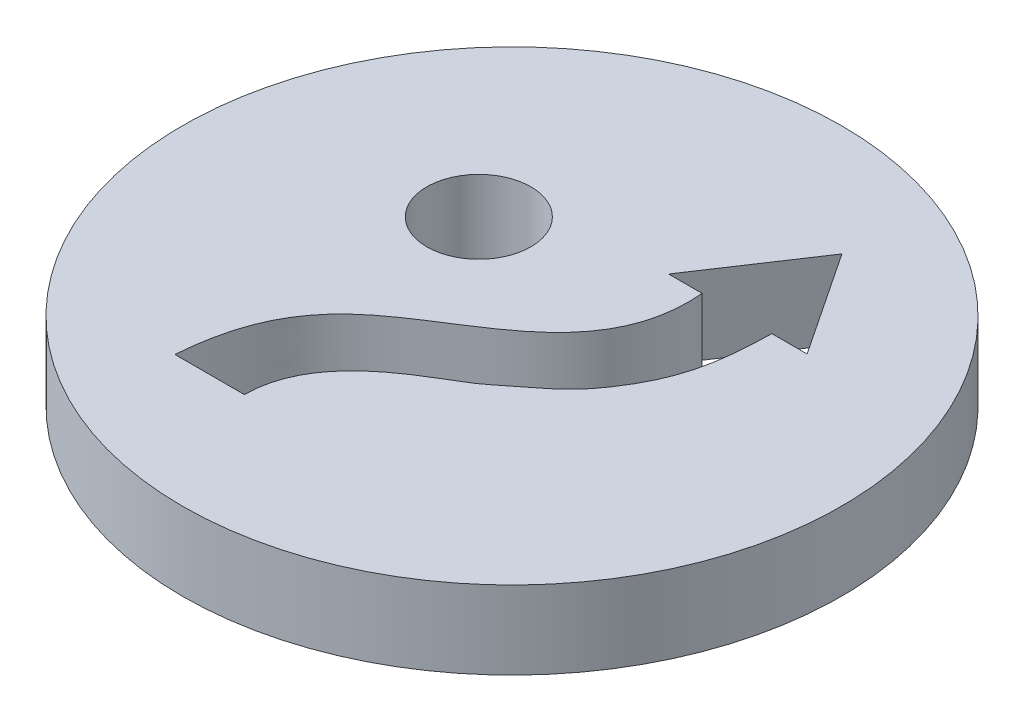
ISO-10303-21;
HEADER;
FILE_DESCRIPTION(('STEP AP214'),'2;1');
FILE_NAME('part.step','',(''),(''),'','','');
FILE_SCHEMA(('AUTOMOTIVE_DESIGN { 1 0 10303 214 1 1 1 1 }'));
ENDSEC;
DATA;
#1=APPLICATION_CONTEXT('core data for automotive mechanical design processes');
#2=APPLICATION_PROTOCOL_DEFINITION('international standard','automotive_design',2000,#1);
#3=PRODUCT_CONTEXT('',#1,'mechanical');
#4=PRODUCT('Part','Part','',(#3));
#5=PRODUCT_RELATED_PRODUCT_CATEGORY('part','',(#4));
#6=PRODUCT_DEFINITION_FORMATION('','',#4);
#7=PRODUCT_DEFINITION_CONTEXT('part definition',#1,'design');
#8=PRODUCT_DEFINITION('design','',#6,#7);
#9=PRODUCT_DEFINITION_SHAPE('','',#8);
#10=(LENGTH_UNIT() NAMED_UNIT(*) SI_UNIT(.MILLI.,.METRE.));
#11=(NAMED_UNIT(*) PLANE_ANGLE_UNIT() SI_UNIT($,.RADIAN.));
#12=(NAMED_UNIT(*) SI_UNIT($,.STERADIAN.) SOLID_ANGLE_UNIT());
#13=UNCERTAINTY_MEASURE_WITH_UNIT(LENGTH_MEASURE(1.E-05),#10,'distance_accuracy_value','');
#14=(GEOMETRIC_REPRESENTATION_CONTEXT(3) GLOBAL_UNCERTAINTY_ASSIGNED_CONTEXT((#13)) GLOBAL_UNIT_ASSIGNED_CONTEXT((#10,
#11,#12)) REPRESENTATION_CONTEXT('',''));
#15=CARTESIAN_POINT('',(0.,0.,0.));
#16=DIRECTION('',(0.,0.,1.));
#17=DIRECTION('',(1.,0.,0.));
#18=AXIS2_PLACEMENT_3D('',#15,#16,#17);
#19=CARTESIAN_POINT('',(0.,2.25,0.));
#20=DIRECTION('',(0.,1.,0.));
#21=DIRECTION('',(0.,0.,1.));
#22=AXIS2_PLACEMENT_3D('',#19,#20,#21);
#23=PLANE('',#22);
#24=DIRECTION('',(1.,0.,0.));
#25=VECTOR('',#24,1.);
#26=CARTESIAN_POINT('',(1.21004151835008,2.25,-3.30341334509573));
#27=LINE('',#26,#25);
#28=CARTESIAN_POINT('',(1.21004151835008,2.25,-3.30341334509573));
#29=VERTEX_POINT('',#28);
#30=CARTESIAN_POINT('',(2.17807473303015,2.25,-3.30341334509573));
#31=VERTEX_POINT('',#30);
#32=EDGE_CURVE('E100',#29,#31,#27,.T.);
#33=ORIENTED_EDGE('',*,*,#32,.F.);
#34=DIRECTION('',(-0.553925235169536,0.,0.832566414073));
#35=VECTOR('',#34,1.);
#36=CARTESIAN_POINT('',(3.20661002362772,2.25,-6.30431631060393));
#37=LINE('',#36,#35);
#38=CARTESIAN_POINT('',(3.20661002362772,2.25,-6.30431631060393));
#39=VERTEX_POINT('',#38);
#40=EDGE_CURVE('E92',#39,#29,#37,.T.);
#41=ORIENTED_EDGE('',*,*,#40,.F.);
#42=DIRECTION('',(-0.553925235169536,0.,-0.832566414073));
#43=VECTOR('',#42,1.);
#44=CARTESIAN_POINT('',(5.20317852890536,2.25,-3.30341334509573));
#45=LINE('',#44,#43);
#46=CARTESIAN_POINT('',(5.20317852890536,2.25,-3.30341334509573));
#47=VERTEX_POINT('',#46);
#48=EDGE_CURVE('E164',#47,#39,#45,.T.);
#49=ORIENTED_EDGE('',*,*,#48,.F.);
#50=DIRECTION('',(1.,0.,0.));
#51=VECTOR('',#50,1.);
#52=CARTESIAN_POINT('',(4.18674365349128,2.25,-3.30341334509573));
#53=LINE('',#52,#51);
#54=CARTESIAN_POINT('',(4.18674365349128,2.25,-3.30341334509573));
#55=VERTEX_POINT('',#54);
#56=EDGE_CURVE('E213',#55,#47,#53,.T.);
#57=ORIENTED_EDGE('',*,*,#56,.F.);
#58=CARTESIAN_POINT('',(-1.89633368908726,2.25,5.8202997032639));
#59=CARTESIAN_POINT('',(-1.8813533702739,2.25,3.72928874018563));
#60=CARTESIAN_POINT('',(0.735292504254355,2.25,2.59323303093661));
#61=CARTESIAN_POINT('',(1.82243536495698,2.25,1.67825474813812));
#62=CARTESIAN_POINT('',(2.66376773128621,2.25,1.10204085577862));
#63=CARTESIAN_POINT('',(3.91664629238123,2.25,-0.656016278320748));
#64=CARTESIAN_POINT('',(4.16233166118346,2.25,-1.71663384508678));
#65=CARTESIAN_POINT('',(4.18674365349128,2.25,-3.30341334509573));
#66=B_SPLINE_CURVE_WITH_KNOTS('',3,(#58,#59,#60,#61,#62,#63,#64,#65),.UNSPECIFIED.,.F.,.F.,(4,1,
1,1,1,4),(0.,0.252147852115317,0.304018445965151,0.494851772661315,0.566835344648502,1.),.UNSPECIFIED.);
#67=CARTESIAN_POINT('',(-1.89633368908726,2.25,5.8202997032639));
#68=VERTEX_POINT('',#67);
#69=EDGE_CURVE('E208',#68,#55,#66,.T.);
#70=ORIENTED_EDGE('',*,*,#69,.F.);
#71=DIRECTION('',(1.,0.,0.));
#72=VECTOR('',#71,1.);
#73=CARTESIAN_POINT('',(-3.89633368908726,2.25,5.8202997032639));
#74=LINE('',#73,#72);
#75=CARTESIAN_POINT('',(-3.89633368908726,2.25,5.8202997032639));
#76=VERTEX_POINT('',#75);
#77=EDGE_CURVE('E115',#76,#68,#74,.T.);
#78=ORIENTED_EDGE('',*,*,#77,.F.);
#79=CARTESIAN_POINT('',(2.17807473303015,2.25,-3.30341334509573));
#80=CARTESIAN_POINT('',(2.44485606526994,2.25,-0.149541278952925));
#81=CARTESIAN_POINT('',(-2.0856295293936,2.25,1.11499166665237));
#82=CARTESIAN_POINT('',(-3.75811010162222,2.25,3.9542812724857));
#83=CARTESIAN_POINT('',(-3.89633368908726,2.25,5.8202997032639));
#84=B_SPLINE_CURVE_WITH_KNOTS('',3,(#79,#80,#81,#82,#83),.UNSPECIFIED.,.F.,.F.,(4,1,4),(0.,
0.630084159638701,1.),.UNSPECIFIED.);
#85=EDGE_CURVE('E113',#31,#76,#84,.T.);
#86=ORIENTED_EDGE('',*,*,#85,.F.);
#87=EDGE_LOOP('',(#33,#41,#49,#57,#70,#78,#86));
#88=FACE_BOUND('',#87,.T.);
#89=CARTESIAN_POINT('',(0.,2.25,0.));
#90=DIRECTION('',(0.,1.,0.));
#91=DIRECTION('',(0.,0.,1.));
#92=AXIS2_PLACEMENT_3D('',#89,#90,#91);
#93=CIRCLE('',#92,9.5);
#94=CARTESIAN_POINT('',(0.,2.25,9.5));
#95=VERTEX_POINT('',#94);
#96=EDGE_CURVE('E11',#95,#95,#93,.T.);
#97=ORIENTED_EDGE('',*,*,#96,.T.);
#98=EDGE_LOOP('',(#97));
#99=FACE_BOUND('',#98,.T.);
#100=CARTESIAN_POINT('',(-2.9525013047742,2.25,-1.99656850527764));
#101=DIRECTION('',(0.,1.,0.));
#102=DIRECTION('',(0.,0.,1.));
#103=AXIS2_PLACEMENT_3D('',#100,#101,#102);
#104=CIRCLE('',#103,1.5);
#105=CARTESIAN_POINT('',(-2.9525013047742,2.25,-0.496568505277636));
#106=VERTEX_POINT('',#105);
#107=EDGE_CURVE('E155',#106,#106,#104,.T.);
#108=ORIENTED_EDGE('',*,*,#107,.F.);
#109=EDGE_LOOP('',(#108));
#110=FACE_BOUND('',#109,.T.);
#111=ADVANCED_FACE('F33',(#88,#99,#110),#23,.T.);
#112=CARTESIAN_POINT('',(0.,0.,0.));
#113=DIRECTION('',(0.,1.,0.));
#114=DIRECTION('',(0.,0.,1.));
#115=AXIS2_PLACEMENT_3D('',#112,#113,#114);
#116=PLANE('',#115);
#117=CARTESIAN_POINT('',(0.,0.,0.));
#118=DIRECTION('',(0.,1.,0.));
#119=DIRECTION('',(0.,0.,1.));
#120=AXIS2_PLACEMENT_3D('',#117,#118,#119);
#121=CIRCLE('',#120,9.5);
#122=CARTESIAN_POINT('',(0.,0.,9.5));
#123=VERTEX_POINT('',#122);
#124=EDGE_CURVE('E37',#123,#123,#121,.T.);
#125=ORIENTED_EDGE('',*,*,#124,.F.);
#126=EDGE_LOOP('',(#125));
#127=FACE_BOUND('',#126,.T.);
#128=DIRECTION('',(-0.553925235169536,0.,0.832566414073));
#129=VECTOR('',#128,1.);
#130=CARTESIAN_POINT('',(3.20661002362772,0.,-6.30431631060393));
#131=LINE('',#130,#129);
#132=CARTESIAN_POINT('',(3.20661002362772,0.,-6.30431631060393));
#133=VERTEX_POINT('',#132);
#134=CARTESIAN_POINT('',(1.21004151835008,0.,-3.30341334509573));
#135=VERTEX_POINT('',#134);
#136=EDGE_CURVE('E56',#133,#135,#131,.T.);
#137=ORIENTED_EDGE('',*,*,#136,.T.);
#138=DIRECTION('',(1.,0.,0.));
#139=VECTOR('',#138,1.);
#140=CARTESIAN_POINT('',(1.21004151835008,0.,-3.30341334509573));
#141=LINE('',#140,#139);
#142=CARTESIAN_POINT('',(2.17807473303015,0.,-3.30341334509573));
#143=VERTEX_POINT('',#142);
#144=EDGE_CURVE('E107',#135,#143,#141,.T.);
#145=ORIENTED_EDGE('',*,*,#144,.T.);
#146=CARTESIAN_POINT('',(2.17807473303015,0.,-3.30341334509573));
#147=CARTESIAN_POINT('',(2.44485606526994,0.,-0.149541278952925));
#148=CARTESIAN_POINT('',(-2.0856295293936,0.,1.11499166665237));
#149=CARTESIAN_POINT('',(-3.75811010162222,0.,3.9542812724857));
#150=CARTESIAN_POINT('',(-3.89633368908726,0.,5.8202997032639));
#151=B_SPLINE_CURVE_WITH_KNOTS('',3,(#146,#147,#148,#149,#150),.UNSPECIFIED.,.F.,.F.,(4,1,4),
(0.,0.630084159638701,1.),.UNSPECIFIED.);
#152=CARTESIAN_POINT('',(-3.89633368908726,0.,5.8202997032639));
#153=VERTEX_POINT('',#152);
#154=EDGE_CURVE('E161',#143,#153,#151,.T.);
#155=ORIENTED_EDGE('',*,*,#154,.T.);
#156=DIRECTION('',(1.,0.,0.));
#157=VECTOR('',#156,1.);
#158=CARTESIAN_POINT('',(-3.89633368908726,0.,5.8202997032639));
#159=LINE('',#158,#157);
#160=CARTESIAN_POINT('',(-1.89633368908726,0.,5.8202997032639));
#161=VERTEX_POINT('',#160);
#162=EDGE_CURVE('E171',#153,#161,#159,.T.);
#163=ORIENTED_EDGE('',*,*,#162,.T.);
#164=CARTESIAN_POINT('',(-1.89633368908726,0.,5.8202997032639));
#165=CARTESIAN_POINT('',(-1.8813533702739,0.,3.72928874018563));
#166=CARTESIAN_POINT('',(0.735292504254355,0.,2.59323303093661));
#167=CARTESIAN_POINT('',(1.82243536495698,0.,1.67825474813812));
#168=CARTESIAN_POINT('',(2.66376773128621,0.,1.10204085577862));
#169=CARTESIAN_POINT('',(3.91664629238123,0.,-0.656016278320748));
#170=CARTESIAN_POINT('',(4.16233166118346,0.,-1.71663384508678));
#171=CARTESIAN_POINT('',(4.18674365349128,0.,-3.30341334509573));
#172=B_SPLINE_CURVE_WITH_KNOTS('',3,(#164,#165,#166,#167,#168,#169,#170,#171),.UNSPECIFIED.,.F.,
.F.,(4,1,1,1,1,4),(0.,0.252147852115317,0.304018445965151,0.494851772661315,0.566835344648502,
1.),.UNSPECIFIED.);
#173=CARTESIAN_POINT('',(4.18674365349128,0.,-3.30341334509573));
#174=VERTEX_POINT('',#173);
#175=EDGE_CURVE('E177',#161,#174,#172,.T.);
#176=ORIENTED_EDGE('',*,*,#175,.T.);
#177=DIRECTION('',(1.,0.,0.));
#178=VECTOR('',#177,1.);
#179=CARTESIAN_POINT('',(4.18674365349128,0.,-3.30341334509573));
#180=LINE('',#179,#178);
#181=CARTESIAN_POINT('',(5.20317852890536,0.,-3.30341334509573));
#182=VERTEX_POINT('',#181);
#183=EDGE_CURVE('E182',#174,#182,#180,.T.);
#184=ORIENTED_EDGE('',*,*,#183,.T.);
#185=DIRECTION('',(-0.553925235169536,0.,-0.832566414073));
#186=VECTOR('',#185,1.);
#187=CARTESIAN_POINT('',(5.20317852890536,0.,-3.30341334509573));
#188=LINE('',#187,#186);
#189=EDGE_CURVE('E101',#182,#133,#188,.T.);
#190=ORIENTED_EDGE('',*,*,#189,.T.);
#191=EDGE_LOOP('',(#137,#145,#155,#163,#176,#184,#190));
#192=FACE_BOUND('',#191,.T.);
#193=CARTESIAN_POINT('',(-2.9525013047742,0.,-1.99656850527764));
#194=DIRECTION('',(0.,1.,0.));
#195=DIRECTION('',(0.,0.,1.));
#196=AXIS2_PLACEMENT_3D('',#193,#194,#195);
#197=CIRCLE('',#196,1.5);
#198=CARTESIAN_POINT('',(-2.9525013047742,0.,-0.496568505277636));
#199=VERTEX_POINT('',#198);
#200=EDGE_CURVE('E153',#199,#199,#197,.T.);
#201=ORIENTED_EDGE('',*,*,#200,.T.);
#202=EDGE_LOOP('',(#201));
#203=FACE_BOUND('',#202,.T.);
#204=ADVANCED_FACE('F139',(#127,#192,#203),#116,.F.);
#205=CARTESIAN_POINT('',(0.,2.25,0.));
#206=DIRECTION('',(0.,-1.,0.));
#207=DIRECTION('',(0.,0.,-1.));
#208=AXIS2_PLACEMENT_3D('',#205,#206,#207);
#209=CYLINDRICAL_SURFACE('',#208,9.5);
#210=ORIENTED_EDGE('',*,*,#96,.F.);
#211=EDGE_LOOP('',(#210));
#212=FACE_BOUND('',#211,.T.);
#213=ORIENTED_EDGE('',*,*,#124,.T.);
#214=EDGE_LOOP('',(#213));
#215=FACE_BOUND('',#214,.T.);
#216=ADVANCED_FACE('F35',(#212,#215),#209,.T.);
#217=CARTESIAN_POINT('',(3.20661002362772,2.25,-6.30431631060393));
#218=DIRECTION('',(0.832566414073,0.,0.553925235169536));
#219=DIRECTION('',(0.553925235169536,0.,-0.832566414073));
#220=AXIS2_PLACEMENT_3D('',#217,#218,#219);
#221=PLANE('',#220);
#222=ORIENTED_EDGE('',*,*,#136,.F.);
#223=DIRECTION('',(0.,-1.,0.));
#224=VECTOR('',#223,1.);
#225=CARTESIAN_POINT('',(3.20661002362772,2.25,-6.30431631060393));
#226=LINE('',#225,#224);
#227=EDGE_CURVE('E96',#39,#133,#226,.T.);
#228=ORIENTED_EDGE('',*,*,#227,.F.);
#229=ORIENTED_EDGE('',*,*,#40,.T.);
#230=DIRECTION('',(0.,-1.,0.));
#231=VECTOR('',#230,1.);
#232=CARTESIAN_POINT('',(1.21004151835008,2.25,-3.30341334509573));
#233=LINE('',#232,#231);
#234=EDGE_CURVE('E95',#29,#135,#233,.T.);
#235=ORIENTED_EDGE('',*,*,#234,.T.);
#236=EDGE_LOOP('',(#222,#228,#229,#235));
#237=FACE_BOUND('',#236,.T.);
#238=ADVANCED_FACE('F94',(#237),#221,.T.);
#239=CARTESIAN_POINT('',(1.21004151835008,2.25,-3.30341334509573));
#240=DIRECTION('',(0.,0.,-1.));
#241=DIRECTION('',(-1.,0.,0.));
#242=AXIS2_PLACEMENT_3D('',#239,#240,#241);
#243=PLANE('',#242);
#244=ORIENTED_EDGE('',*,*,#144,.F.);
#245=ORIENTED_EDGE('',*,*,#234,.F.);
#246=ORIENTED_EDGE('',*,*,#32,.T.);
#247=DIRECTION('',(0.,-1.,0.));
#248=VECTOR('',#247,1.);
#249=CARTESIAN_POINT('',(2.17807473303015,2.25,-3.30341334509573));
#250=LINE('',#249,#248);
#251=EDGE_CURVE('E108',#31,#143,#250,.T.);
#252=ORIENTED_EDGE('',*,*,#251,.T.);
#253=EDGE_LOOP('',(#244,#245,#246,#252));
#254=FACE_BOUND('',#253,.T.);
#255=ADVANCED_FACE('F104',(#254),#243,.T.);
#256=DIRECTION('',(0.,-1.,0.));
#257=VECTOR('',#256,1.);
#258=SURFACE_OF_LINEAR_EXTRUSION('',#84,#257);
#259=ORIENTED_EDGE('',*,*,#154,.F.);
#260=ORIENTED_EDGE('',*,*,#251,.F.);
#261=ORIENTED_EDGE('',*,*,#85,.T.);
#262=DIRECTION('',(0.,-1.,0.));
#263=VECTOR('',#262,1.);
#264=CARTESIAN_POINT('',(-3.89633368908726,2.25,5.8202997032639));
#265=LINE('',#264,#263);
#266=EDGE_CURVE('E195',#76,#153,#265,.T.);
#267=ORIENTED_EDGE('',*,*,#266,.T.);
#268=EDGE_LOOP('',(#259,#260,#261,#267));
#269=FACE_BOUND('',#268,.T.);
#270=ADVANCED_FACE('F127',(#269),#258,.T.);
#271=CARTESIAN_POINT('',(-3.89633368908726,2.25,5.8202997032639));
#272=DIRECTION('',(0.,0.,-1.));
#273=DIRECTION('',(-1.,0.,0.));
#274=AXIS2_PLACEMENT_3D('',#271,#272,#273);
#275=PLANE('',#274);
#276=ORIENTED_EDGE('',*,*,#162,.F.);
#277=ORIENTED_EDGE('',*,*,#266,.F.);
#278=ORIENTED_EDGE('',*,*,#77,.T.);
#279=DIRECTION('',(0.,-1.,0.));
#280=VECTOR('',#279,1.);
#281=CARTESIAN_POINT('',(-1.89633368908726,2.25,5.8202997032639));
#282=LINE('',#281,#280);
#283=EDGE_CURVE('E193',#68,#161,#282,.T.);
#284=ORIENTED_EDGE('',*,*,#283,.T.);
#285=EDGE_LOOP('',(#276,#277,#278,#284));
#286=FACE_BOUND('',#285,.T.);
#287=ADVANCED_FACE('F131',(#286),#275,.T.);
#288=DIRECTION('',(0.,-1.,0.));
#289=VECTOR('',#288,1.);
#290=SURFACE_OF_LINEAR_EXTRUSION('',#66,#289);
#291=ORIENTED_EDGE('',*,*,#175,.F.);
#292=ORIENTED_EDGE('',*,*,#283,.F.);
#293=ORIENTED_EDGE('',*,*,#69,.T.);
#294=DIRECTION('',(0.,-1.,0.));
#295=VECTOR('',#294,1.);
#296=CARTESIAN_POINT('',(4.18674365349128,2.25,-3.30341334509573));
#297=LINE('',#296,#295);
#298=EDGE_CURVE('E191',#55,#174,#297,.T.);
#299=ORIENTED_EDGE('',*,*,#298,.T.);
#300=EDGE_LOOP('',(#291,#292,#293,#299));
#301=FACE_BOUND('',#300,.T.);
#302=ADVANCED_FACE('F205',(#301),#290,.T.);
#303=CARTESIAN_POINT('',(4.18674365349128,2.25,-3.30341334509573));
#304=DIRECTION('',(0.,0.,-1.));
#305=DIRECTION('',(-1.,0.,0.));
#306=AXIS2_PLACEMENT_3D('',#303,#304,#305);
#307=PLANE('',#306);
#308=ORIENTED_EDGE('',*,*,#183,.F.);
#309=ORIENTED_EDGE('',*,*,#298,.F.);
#310=ORIENTED_EDGE('',*,*,#56,.T.);
#311=DIRECTION('',(0.,-1.,0.));
#312=VECTOR('',#311,1.);
#313=CARTESIAN_POINT('',(5.20317852890536,2.25,-3.30341334509573));
#314=LINE('',#313,#312);
#315=EDGE_CURVE('E48',#47,#182,#314,.T.);
#316=ORIENTED_EDGE('',*,*,#315,.T.);
#317=EDGE_LOOP('',(#308,#309,#310,#316));
#318=FACE_BOUND('',#317,.T.);
#319=ADVANCED_FACE('F211',(#318),#307,.T.);
#320=CARTESIAN_POINT('',(5.20317852890536,2.25,-3.30341334509573));
#321=DIRECTION('',(-0.832566414073,0.,0.553925235169536));
#322=DIRECTION('',(0.553925235169536,0.,0.832566414073));
#323=AXIS2_PLACEMENT_3D('',#320,#321,#322);
#324=PLANE('',#323);
#325=ORIENTED_EDGE('',*,*,#189,.F.);
#326=ORIENTED_EDGE('',*,*,#315,.F.);
#327=ORIENTED_EDGE('',*,*,#48,.T.);
#328=ORIENTED_EDGE('',*,*,#227,.T.);
#329=EDGE_LOOP('',(#325,#326,#327,#328));
#330=FACE_BOUND('',#329,.T.);
#331=ADVANCED_FACE('F212',(#330),#324,.T.);
#332=CARTESIAN_POINT('',(-2.9525013047742,2.25,-1.99656850527764));
#333=DIRECTION('',(0.,-1.,0.));
#334=DIRECTION('',(0.,0.,-1.));
#335=AXIS2_PLACEMENT_3D('',#332,#333,#334);
#336=CYLINDRICAL_SURFACE('',#335,1.5);
#337=ORIENTED_EDGE('',*,*,#107,.T.);
#338=EDGE_LOOP('',(#337));
#339=FACE_BOUND('',#338,.T.);
#340=ORIENTED_EDGE('',*,*,#200,.F.);
#341=EDGE_LOOP('',(#340));
#342=FACE_BOUND('',#341,.T.);
#343=ADVANCED_FACE('F226',(#339,#342),#336,.F.);
#344=CLOSED_SHELL('',(#111,#204,#216,#238,#255,#270,#287,#302,#319,#331,#343));
#345=MANIFOLD_SOLID_BREP('B2',#344);
#346=ADVANCED_BREP_SHAPE_REPRESENTATION('',(#18,#345),#14);
#347=SHAPE_DEFINITION_REPRESENTATION(#9,#346);
ENDSEC;
END-ISO-10303-21;
